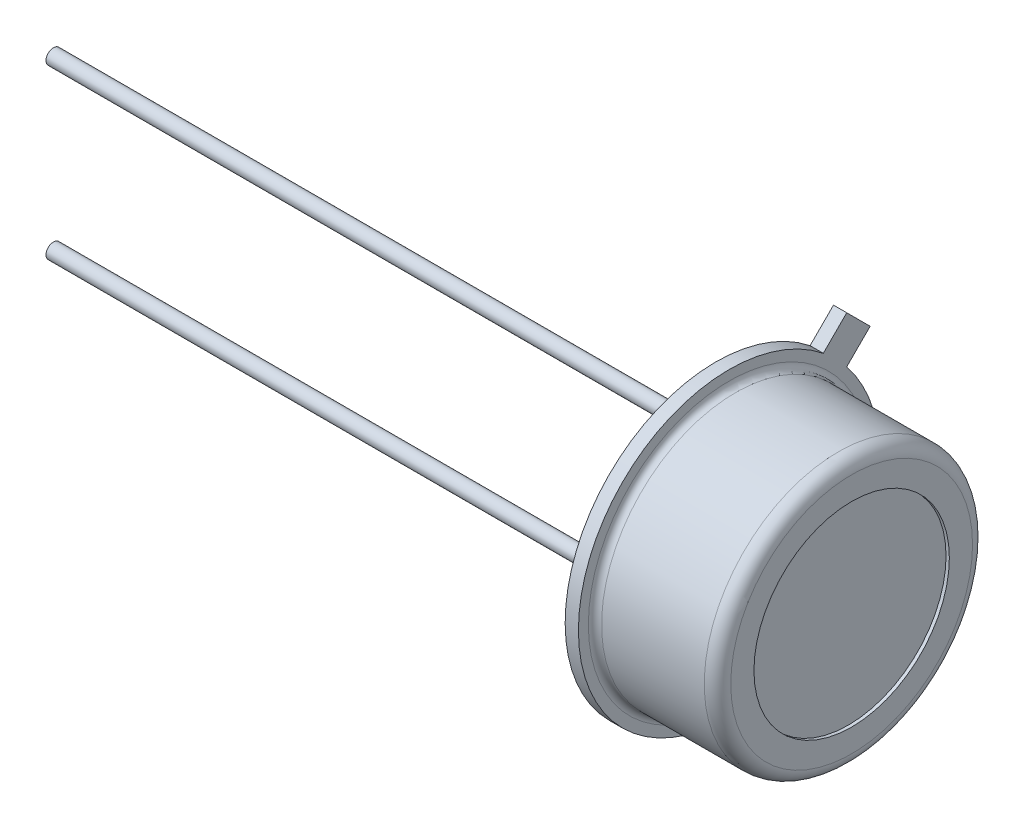
ISO-10303-21;
HEADER;
FILE_DESCRIPTION(('STEP AP214'),'2;1');
FILE_NAME('part.step','',(''),(''),'','','');
FILE_SCHEMA(('AUTOMOTIVE_DESIGN { 1 0 10303 214 1 1 1 1 }'));
ENDSEC;
DATA;
#1=APPLICATION_CONTEXT('core data for automotive mechanical design processes');
#2=APPLICATION_PROTOCOL_DEFINITION('international standard','automotive_design',2000,#1);
#3=PRODUCT_CONTEXT('',#1,'mechanical');
#4=PRODUCT('Part','Part','',(#3));
#5=PRODUCT_RELATED_PRODUCT_CATEGORY('part','',(#4));
#6=PRODUCT_DEFINITION_FORMATION('','',#4);
#7=PRODUCT_DEFINITION_CONTEXT('part definition',#1,'design');
#8=PRODUCT_DEFINITION('design','',#6,#7);
#9=PRODUCT_DEFINITION_SHAPE('','',#8);
#10=(LENGTH_UNIT() NAMED_UNIT(*) SI_UNIT(.MILLI.,.METRE.));
#11=(NAMED_UNIT(*) PLANE_ANGLE_UNIT() SI_UNIT($,.RADIAN.));
#12=(NAMED_UNIT(*) SI_UNIT($,.STERADIAN.) SOLID_ANGLE_UNIT());
#13=UNCERTAINTY_MEASURE_WITH_UNIT(LENGTH_MEASURE(1.E-05),#10,'distance_accuracy_value','');
#14=(GEOMETRIC_REPRESENTATION_CONTEXT(3) GLOBAL_UNCERTAINTY_ASSIGNED_CONTEXT((#13)) GLOBAL_UNIT_ASSIGNED_CONTEXT((#10,
#11,#12)) REPRESENTATION_CONTEXT('',''));
#15=CARTESIAN_POINT('',(0.,0.,0.));
#16=DIRECTION('',(0.,0.,1.));
#17=DIRECTION('',(1.,0.,0.));
#18=AXIS2_PLACEMENT_3D('',#15,#16,#17);
#19=CARTESIAN_POINT('',(0.,0.,0.));
#20=DIRECTION('',(-1.,0.,0.));
#21=DIRECTION('',(0.,0.,-1.));
#22=AXIS2_PLACEMENT_3D('',#19,#20,#21);
#23=PLANE('',#22);
#24=CARTESIAN_POINT('',(0.,0.,0.));
#25=DIRECTION('',(1.,0.,0.));
#26=DIRECTION('',(0.,0.780528402503835,-0.625120318726572));
#27=AXIS2_PLACEMENT_3D('',#24,#25,#26);
#28=CIRCLE('',#27,4.55);
#29=CARTESIAN_POINT('',(0.,3.55140423139245,-2.8442974502059));
#30=VERTEX_POINT('',#29);
#31=CARTESIAN_POINT('',(0.,2.8442974502059,-3.55140423139245));
#32=VERTEX_POINT('',#31);
#33=EDGE_CURVE('P0_E11',#30,#32,#28,.T.);
#34=ORIENTED_EDGE('',*,*,#33,.F.);
#35=DIRECTION('',(0.,0.707106781186547,-0.707106781186548));
#36=VECTOR('',#35,1.);
#37=CARTESIAN_POINT('',(0.,3.55140423139245,-2.8442974502059));
#38=LINE('',#37,#36);
#39=CARTESIAN_POINT('',(0.,4.258511012579,-3.55140423139245));
#40=VERTEX_POINT('',#39);
#41=EDGE_CURVE('P0_E201',#30,#40,#38,.T.);
#42=ORIENTED_EDGE('',*,*,#41,.T.);
#43=DIRECTION('',(0.,-0.707106781186547,-0.707106781186548));
#44=VECTOR('',#43,1.);
#45=CARTESIAN_POINT('',(0.,4.258511012579,-3.55140423139245));
#46=LINE('',#45,#44);
#47=CARTESIAN_POINT('',(0.,3.55140423139245,-4.258511012579));
#48=VERTEX_POINT('',#47);
#49=EDGE_CURVE('P0_E189',#40,#48,#46,.T.);
#50=ORIENTED_EDGE('',*,*,#49,.T.);
#51=DIRECTION('',(0.,-0.707106781186547,0.707106781186548));
#52=VECTOR('',#51,1.);
#53=CARTESIAN_POINT('',(0.,3.55140423139245,-4.258511012579));
#54=LINE('',#53,#52);
#55=EDGE_CURVE('P0_E177',#48,#32,#54,.T.);
#56=ORIENTED_EDGE('',*,*,#55,.T.);
#57=EDGE_LOOP('',(#34,#42,#50,#56));
#58=FACE_BOUND('',#57,.T.);
#59=CARTESIAN_POINT('',(0.,2.54,0.));
#60=DIRECTION('',(-1.,0.,0.));
#61=DIRECTION('',(0.,0.,-1.));
#62=AXIS2_PLACEMENT_3D('',#59,#60,#61);
#63=CIRCLE('',#62,0.225);
#64=CARTESIAN_POINT('',(0.,2.54,-0.224999999999999));
#65=VERTEX_POINT('',#64);
#66=EDGE_CURVE('P0_E198',#65,#65,#63,.T.);
#67=ORIENTED_EDGE('',*,*,#66,.F.);
#68=EDGE_LOOP('',(#67));
#69=FACE_BOUND('',#68,.T.);
#70=CARTESIAN_POINT('',(0.,-2.54,0.));
#71=DIRECTION('',(-1.,0.,0.));
#72=DIRECTION('',(0.,0.,-1.));
#73=AXIS2_PLACEMENT_3D('',#70,#71,#72);
#74=CIRCLE('',#73,0.225);
#75=CARTESIAN_POINT('',(0.,-2.54,-0.225));
#76=VERTEX_POINT('',#75);
#77=EDGE_CURVE('P0_E186',#76,#76,#74,.T.);
#78=ORIENTED_EDGE('',*,*,#77,.F.);
#79=EDGE_LOOP('',(#78));
#80=FACE_BOUND('',#79,.T.);
#81=ADVANCED_FACE('P0_F17',(#58,#69,#80),#23,.T.);
#82=CARTESIAN_POINT('',(0.4,0.,0.));
#83=DIRECTION('',(1.,0.,0.));
#84=DIRECTION('',(0.,0.,-1.));
#85=AXIS2_PLACEMENT_3D('',#82,#83,#84);
#86=PLANE('',#85);
#87=DIRECTION('',(0.,0.707106781186547,-0.707106781186548));
#88=VECTOR('',#87,1.);
#89=CARTESIAN_POINT('',(0.4,2.8442974502059,-3.55140423139245));
#90=LINE('',#89,#88);
#91=CARTESIAN_POINT('',(0.4,2.8442974502059,-3.55140423139245));
#92=VERTEX_POINT('',#91);
#93=CARTESIAN_POINT('',(0.4,3.55140423139245,-4.258511012579));
#94=VERTEX_POINT('',#93);
#95=EDGE_CURVE('P0_E24',#92,#94,#90,.T.);
#96=ORIENTED_EDGE('',*,*,#95,.T.);
#97=DIRECTION('',(0.,0.707106781186547,0.707106781186548));
#98=VECTOR('',#97,1.);
#99=CARTESIAN_POINT('',(0.4,3.55140423139245,-4.258511012579));
#100=LINE('',#99,#98);
#101=CARTESIAN_POINT('',(0.4,4.258511012579,-3.55140423139245));
#102=VERTEX_POINT('',#101);
#103=EDGE_CURVE('P0_E194',#94,#102,#100,.T.);
#104=ORIENTED_EDGE('',*,*,#103,.T.);
#105=DIRECTION('',(0.,-0.707106781186547,0.707106781186548));
#106=VECTOR('',#105,1.);
#107=CARTESIAN_POINT('',(0.4,4.258511012579,-3.55140423139245));
#108=LINE('',#107,#106);
#109=CARTESIAN_POINT('',(0.4,3.55140423139245,-2.8442974502059));
#110=VERTEX_POINT('',#109);
#111=EDGE_CURVE('P0_E179',#102,#110,#108,.T.);
#112=ORIENTED_EDGE('',*,*,#111,.T.);
#113=CARTESIAN_POINT('',(0.4,0.,0.));
#114=DIRECTION('',(1.,0.,0.));
#115=DIRECTION('',(0.,0.780528402503835,-0.625120318726572));
#116=AXIS2_PLACEMENT_3D('',#113,#114,#115);
#117=CIRCLE('',#116,4.55);
#118=EDGE_CURVE('P0_E182',#110,#92,#117,.T.);
#119=ORIENTED_EDGE('',*,*,#118,.T.);
#120=EDGE_LOOP('',(#96,#104,#112,#119));
#121=FACE_BOUND('',#120,.T.);
#122=CARTESIAN_POINT('',(0.4,0.,0.));
#123=DIRECTION('',(1.,0.,0.));
#124=DIRECTION('',(0.,0.,-1.));
#125=AXIS2_PLACEMENT_3D('',#122,#123,#124);
#126=CIRCLE('',#125,4.25);
#127=CARTESIAN_POINT('',(0.4,0.,-4.25));
#128=VERTEX_POINT('',#127);
#129=EDGE_CURVE('P0_E191',#128,#128,#126,.T.);
#130=ORIENTED_EDGE('',*,*,#129,.F.);
#131=EDGE_LOOP('',(#130));
#132=FACE_BOUND('',#131,.T.);
#133=ADVANCED_FACE('P0_F219',(#121,#132),#86,.T.);
#134=CARTESIAN_POINT('',(0.,0.,0.));
#135=DIRECTION('',(1.,0.,0.));
#136=DIRECTION('',(0.,0.,-1.));
#137=AXIS2_PLACEMENT_3D('',#134,#135,#136);
#138=CYLINDRICAL_SURFACE('',#137,4.55);
#139=DIRECTION('',(1.,0.,0.));
#140=VECTOR('',#139,1.);
#141=CARTESIAN_POINT('',(0.,2.8442974502059,-3.55140423139245));
#142=LINE('',#141,#140);
#143=EDGE_CURVE('P0_E196',#32,#92,#142,.T.);
#144=ORIENTED_EDGE('',*,*,#143,.T.);
#145=ORIENTED_EDGE('',*,*,#118,.F.);
#146=DIRECTION('',(1.,0.,0.));
#147=VECTOR('',#146,1.);
#148=CARTESIAN_POINT('',(0.,3.55140423139245,-2.8442974502059));
#149=LINE('',#148,#147);
#150=EDGE_CURVE('P0_E184',#30,#110,#149,.T.);
#151=ORIENTED_EDGE('',*,*,#150,.F.);
#152=ORIENTED_EDGE('',*,*,#33,.T.);
#153=EDGE_LOOP('',(#144,#145,#151,#152));
#154=FACE_BOUND('',#153,.T.);
#155=ADVANCED_FACE('P0_F218',(#154),#138,.T.);
#156=CARTESIAN_POINT('',(1.4,3.55140423139245,-2.8442974502059));
#157=DIRECTION('',(0.,0.707106781186548,0.707106781186548));
#158=DIRECTION('',(0.,0.707106781186548,-0.707106781186548));
#159=AXIS2_PLACEMENT_3D('',#156,#157,#158);
#160=PLANE('',#159);
#161=ORIENTED_EDGE('',*,*,#150,.T.);
#162=ORIENTED_EDGE('',*,*,#111,.F.);
#163=DIRECTION('',(-1.,0.,0.));
#164=VECTOR('',#163,1.);
#165=CARTESIAN_POINT('',(0.4,4.258511012579,-3.55140423139245));
#166=LINE('',#165,#164);
#167=EDGE_CURVE('P0_E174',#102,#40,#166,.T.);
#168=ORIENTED_EDGE('',*,*,#167,.T.);
#169=ORIENTED_EDGE('',*,*,#41,.F.);
#170=EDGE_LOOP('',(#161,#162,#168,#169));
#171=FACE_BOUND('',#170,.T.);
#172=ADVANCED_FACE('P0_F209',(#171),#160,.T.);
#173=CARTESIAN_POINT('',(1.4,3.55140423139245,-4.258511012579));
#174=DIRECTION('',(0.,-0.707106781186548,-0.707106781186547));
#175=DIRECTION('',(0.,-0.707106781186547,0.707106781186548));
#176=AXIS2_PLACEMENT_3D('',#173,#174,#175);
#177=PLANE('',#176);
#178=ORIENTED_EDGE('',*,*,#143,.F.);
#179=ORIENTED_EDGE('',*,*,#55,.F.);
#180=DIRECTION('',(-1.,0.,0.));
#181=VECTOR('',#180,1.);
#182=CARTESIAN_POINT('',(0.4,3.55140423139245,-4.258511012579));
#183=LINE('',#182,#181);
#184=EDGE_CURVE('P0_E171',#94,#48,#183,.T.);
#185=ORIENTED_EDGE('',*,*,#184,.F.);
#186=ORIENTED_EDGE('',*,*,#95,.F.);
#187=EDGE_LOOP('',(#178,#179,#185,#186));
#188=FACE_BOUND('',#187,.T.);
#189=ADVANCED_FACE('P0_F215',(#188),#177,.T.);
#190=CARTESIAN_POINT('',(1.4,4.258511012579,-3.55140423139245));
#191=DIRECTION('',(0.,0.707106781186548,-0.707106781186547));
#192=DIRECTION('',(0.,-0.707106781186547,-0.707106781186548));
#193=AXIS2_PLACEMENT_3D('',#190,#191,#192);
#194=PLANE('',#193);
#195=ORIENTED_EDGE('',*,*,#103,.F.);
#196=ORIENTED_EDGE('',*,*,#184,.T.);
#197=ORIENTED_EDGE('',*,*,#49,.F.);
#198=ORIENTED_EDGE('',*,*,#167,.F.);
#199=EDGE_LOOP('',(#195,#196,#197,#198));
#200=FACE_BOUND('',#199,.T.);
#201=ADVANCED_FACE('P0_F211',(#200),#194,.T.);
#202=CARTESIAN_POINT('',(0.,2.54,0.));
#203=DIRECTION('',(-1.,0.,0.));
#204=DIRECTION('',(0.,0.,-1.));
#205=AXIS2_PLACEMENT_3D('',#202,#203,#204);
#206=CYLINDRICAL_SURFACE('',#205,0.225);
#207=ORIENTED_EDGE('',*,*,#66,.T.);
#208=EDGE_LOOP('',(#207));
#209=FACE_BOUND('',#208,.T.);
#210=CARTESIAN_POINT('',(-20.,2.54,0.));
#211=DIRECTION('',(-1.,0.,0.));
#212=DIRECTION('',(0.,0.,-1.));
#213=AXIS2_PLACEMENT_3D('',#210,#211,#212);
#214=CIRCLE('',#213,0.225);
#215=CARTESIAN_POINT('',(-20.,2.54,-0.224999999999999));
#216=VERTEX_POINT('',#215);
#217=EDGE_CURVE('P0_E168',#216,#216,#214,.T.);
#218=ORIENTED_EDGE('',*,*,#217,.F.);
#219=EDGE_LOOP('',(#218));
#220=FACE_BOUND('',#219,.T.);
#221=ADVANCED_FACE('P0_F237',(#209,#220),#206,.T.);
#222=CARTESIAN_POINT('',(0.,-2.54,0.));
#223=DIRECTION('',(-1.,0.,0.));
#224=DIRECTION('',(0.,0.,-1.));
#225=AXIS2_PLACEMENT_3D('',#222,#223,#224);
#226=CYLINDRICAL_SURFACE('',#225,0.225);
#227=ORIENTED_EDGE('',*,*,#77,.T.);
#228=EDGE_LOOP('',(#227));
#229=FACE_BOUND('',#228,.T.);
#230=CARTESIAN_POINT('',(-20.,-2.54,0.));
#231=DIRECTION('',(-1.,0.,0.));
#232=DIRECTION('',(0.,0.,-1.));
#233=AXIS2_PLACEMENT_3D('',#230,#231,#232);
#234=CIRCLE('',#233,0.225);
#235=CARTESIAN_POINT('',(-20.,-2.54,-0.225));
#236=VERTEX_POINT('',#235);
#237=EDGE_CURVE('P0_E162',#236,#236,#234,.T.);
#238=ORIENTED_EDGE('',*,*,#237,.F.);
#239=EDGE_LOOP('',(#238));
#240=FACE_BOUND('',#239,.T.);
#241=ADVANCED_FACE('P0_F226',(#229,#240),#226,.T.);
#242=CARTESIAN_POINT('',(0.599999999999999,0.,0.));
#243=DIRECTION('',(1.,0.,0.));
#244=DIRECTION('',(0.,0.,-1.));
#245=AXIS2_PLACEMENT_3D('',#242,#243,#244);
#246=TOROIDAL_SURFACE('',#245,4.25,0.2);
#247=CARTESIAN_POINT('',(0.599999999999999,0.,0.));
#248=DIRECTION('',(1.,0.,0.));
#249=DIRECTION('',(0.,0.,-1.));
#250=AXIS2_PLACEMENT_3D('',#247,#248,#249);
#251=CIRCLE('',#250,4.05);
#252=CARTESIAN_POINT('',(0.599999999999999,0.,-4.05));
#253=VERTEX_POINT('',#252);
#254=EDGE_CURVE('P0_E165',#253,#253,#251,.T.);
#255=ORIENTED_EDGE('',*,*,#254,.F.);
#256=EDGE_LOOP('',(#255));
#257=FACE_BOUND('',#256,.T.);
#258=ORIENTED_EDGE('',*,*,#129,.T.);
#259=EDGE_LOOP('',(#258));
#260=FACE_BOUND('',#259,.T.);
#261=ADVANCED_FACE('P0_F223',(#257,#260),#246,.F.);
#262=CARTESIAN_POINT('',(-20.,5.08,0.));
#263=DIRECTION('',(-1.,0.,0.));
#264=DIRECTION('',(0.,0.,-1.));
#265=AXIS2_PLACEMENT_3D('',#262,#263,#264);
#266=PLANE('',#265);
#267=ORIENTED_EDGE('',*,*,#217,.T.);
#268=EDGE_LOOP('',(#267));
#269=FACE_BOUND('',#268,.T.);
#270=ADVANCED_FACE('P0_F225',(#269),#266,.T.);
#271=CARTESIAN_POINT('',(-20.,0.,0.));
#272=DIRECTION('',(-1.,0.,0.));
#273=DIRECTION('',(0.,0.,-1.));
#274=AXIS2_PLACEMENT_3D('',#271,#272,#273);
#275=PLANE('',#274);
#276=ORIENTED_EDGE('',*,*,#237,.T.);
#277=EDGE_LOOP('',(#276));
#278=FACE_BOUND('',#277,.T.);
#279=ADVANCED_FACE('P0_F234',(#278),#275,.T.);
#280=CARTESIAN_POINT('',(0.599999999999999,0.,0.));
#281=DIRECTION('',(1.,0.,0.));
#282=DIRECTION('',(0.,0.,-1.));
#283=AXIS2_PLACEMENT_3D('',#280,#281,#282);
#284=CYLINDRICAL_SURFACE('',#283,4.05);
#285=CARTESIAN_POINT('',(3.7,0.,0.));
#286=DIRECTION('',(1.,0.,0.));
#287=DIRECTION('',(0.,0.,-1.));
#288=AXIS2_PLACEMENT_3D('',#285,#286,#287);
#289=CIRCLE('',#288,4.05);
#290=CARTESIAN_POINT('',(3.7,0.,-4.05));
#291=VERTEX_POINT('',#290);
#292=EDGE_CURVE('P0_E159',#291,#291,#289,.T.);
#293=ORIENTED_EDGE('',*,*,#292,.F.);
#294=EDGE_LOOP('',(#293));
#295=FACE_BOUND('',#294,.T.);
#296=ORIENTED_EDGE('',*,*,#254,.T.);
#297=EDGE_LOOP('',(#296));
#298=FACE_BOUND('',#297,.T.);
#299=ADVANCED_FACE('P0_F311',(#295,#298),#284,.T.);
#300=CARTESIAN_POINT('',(3.7,0.,0.));
#301=DIRECTION('',(1.,0.,0.));
#302=DIRECTION('',(0.,0.,-1.));
#303=AXIS2_PLACEMENT_3D('',#300,#301,#302);
#304=TOROIDAL_SURFACE('',#303,3.65,0.4);
#305=CARTESIAN_POINT('',(4.1,0.,0.));
#306=DIRECTION('',(1.,0.,0.));
#307=DIRECTION('',(0.,0.,-1.));
#308=AXIS2_PLACEMENT_3D('',#305,#306,#307);
#309=CIRCLE('',#308,3.65);
#310=CARTESIAN_POINT('',(4.1,0.,-3.65));
#311=VERTEX_POINT('',#310);
#312=EDGE_CURVE('P0_E156',#311,#311,#309,.T.);
#313=ORIENTED_EDGE('',*,*,#312,.F.);
#314=EDGE_LOOP('',(#313));
#315=FACE_BOUND('',#314,.T.);
#316=ORIENTED_EDGE('',*,*,#292,.T.);
#317=EDGE_LOOP('',(#316));
#318=FACE_BOUND('',#317,.T.);
#319=ADVANCED_FACE('P0_F417',(#315,#318),#304,.T.);
#320=CARTESIAN_POINT('',(4.1,0.,0.));
#321=DIRECTION('',(1.,0.,0.));
#322=DIRECTION('',(0.,0.,-1.));
#323=AXIS2_PLACEMENT_3D('',#320,#321,#322);
#324=PLANE('',#323);
#325=ORIENTED_EDGE('',*,*,#312,.T.);
#326=EDGE_LOOP('',(#325));
#327=FACE_BOUND('',#326,.T.);
#328=CARTESIAN_POINT('',(4.1,0.,0.));
#329=DIRECTION('',(1.,0.,0.));
#330=DIRECTION('',(0.,0.,1.));
#331=AXIS2_PLACEMENT_3D('',#328,#329,#330);
#332=CIRCLE('',#331,2.95);
#333=CARTESIAN_POINT('',(4.1,0.,2.95));
#334=VERTEX_POINT('',#333);
#335=EDGE_CURVE('P0_E154',#334,#334,#332,.T.);
#336=ORIENTED_EDGE('',*,*,#335,.F.);
#337=EDGE_LOOP('',(#336));
#338=FACE_BOUND('',#337,.T.);
#339=ADVANCED_FACE('P0_F406',(#327,#338),#324,.T.);
#340=CARTESIAN_POINT('',(2.1,0.,0.));
#341=DIRECTION('',(1.,0.,0.));
#342=DIRECTION('',(0.,0.,1.));
#343=AXIS2_PLACEMENT_3D('',#340,#341,#342);
#344=CYLINDRICAL_SURFACE('',#343,2.95);
#345=ORIENTED_EDGE('',*,*,#335,.T.);
#346=EDGE_LOOP('',(#345));
#347=FACE_BOUND('',#346,.T.);
#348=CARTESIAN_POINT('',(2.1,0.,0.));
#349=DIRECTION('',(1.,0.,0.));
#350=DIRECTION('',(0.,0.,1.));
#351=AXIS2_PLACEMENT_3D('',#348,#349,#350);
#352=CIRCLE('',#351,2.95);
#353=CARTESIAN_POINT('',(2.1,0.,2.95));
#354=VERTEX_POINT('',#353);
#355=EDGE_CURVE('P0_E152',#354,#354,#352,.T.);
#356=ORIENTED_EDGE('',*,*,#355,.F.);
#357=EDGE_LOOP('',(#356));
#358=FACE_BOUND('',#357,.T.);
#359=ADVANCED_FACE('P0_F395',(#347,#358),#344,.F.);
#360=CARTESIAN_POINT('',(2.1,0.,0.));
#361=DIRECTION('',(1.,0.,0.));
#362=DIRECTION('',(0.,0.,1.));
#363=AXIS2_PLACEMENT_3D('',#360,#361,#362);
#364=PLANE('',#363);
#365=ORIENTED_EDGE('',*,*,#355,.T.);
#366=EDGE_LOOP('',(#365));
#367=FACE_BOUND('',#366,.T.);
#368=DIRECTION('',(0.,-1.,0.));
#369=VECTOR('',#368,1.);
#370=CARTESIAN_POINT('',(2.1,1.2,1.2));
#371=LINE('',#370,#369);
#372=CARTESIAN_POINT('',(2.1,1.2,1.2));
#373=VERTEX_POINT('',#372);
#374=CARTESIAN_POINT('',(2.1,-1.2,1.2));
#375=VERTEX_POINT('',#374);
#376=EDGE_CURVE('P0_E150',#373,#375,#371,.T.);
#377=ORIENTED_EDGE('',*,*,#376,.F.);
#378=DIRECTION('',(0.,0.,1.));
#379=VECTOR('',#378,1.);
#380=CARTESIAN_POINT('',(2.1,1.2,-1.2));
#381=LINE('',#380,#379);
#382=CARTESIAN_POINT('',(2.1,1.2,-1.2));
#383=VERTEX_POINT('',#382);
#384=EDGE_CURVE('P0_E147',#383,#373,#381,.T.);
#385=ORIENTED_EDGE('',*,*,#384,.F.);
#386=DIRECTION('',(0.,1.,0.));
#387=VECTOR('',#386,1.);
#388=CARTESIAN_POINT('',(2.1,-1.2,-1.2));
#389=LINE('',#388,#387);
#390=CARTESIAN_POINT('',(2.1,-1.2,-1.2));
#391=VERTEX_POINT('',#390);
#392=EDGE_CURVE('P0_E143',#391,#383,#389,.T.);
#393=ORIENTED_EDGE('',*,*,#392,.F.);
#394=DIRECTION('',(0.,0.,-1.));
#395=VECTOR('',#394,1.);
#396=CARTESIAN_POINT('',(2.1,-1.2,1.2));
#397=LINE('',#396,#395);
#398=EDGE_CURVE('P0_E117',#375,#391,#397,.T.);
#399=ORIENTED_EDGE('',*,*,#398,.F.);
#400=EDGE_LOOP('',(#377,#385,#393,#399));
#401=FACE_BOUND('',#400,.T.);
#402=ADVANCED_FACE('P0_F326',(#367,#401),#364,.T.);
#403=CARTESIAN_POINT('',(2.1,1.2,1.2));
#404=DIRECTION('',(0.,0.,1.));
#405=DIRECTION('',(0.,-1.,0.));
#406=AXIS2_PLACEMENT_3D('',#403,#404,#405);
#407=PLANE('',#406);
#408=ORIENTED_EDGE('',*,*,#376,.T.);
#409=DIRECTION('',(1.,0.,0.));
#410=VECTOR('',#409,1.);
#411=CARTESIAN_POINT('',(2.1,-1.2,1.2));
#412=LINE('',#411,#410);
#413=CARTESIAN_POINT('',(2.8,-1.2,1.2));
#414=VERTEX_POINT('',#413);
#415=EDGE_CURVE('P0_E145',#375,#414,#412,.T.);
#416=ORIENTED_EDGE('',*,*,#415,.T.);
#417=DIRECTION('',(0.,-1.,0.));
#418=VECTOR('',#417,1.);
#419=CARTESIAN_POINT('',(2.8,1.2,1.2));
#420=LINE('',#419,#418);
#421=CARTESIAN_POINT('',(2.8,1.2,1.2));
#422=VERTEX_POINT('',#421);
#423=EDGE_CURVE('P0_E134',#422,#414,#420,.T.);
#424=ORIENTED_EDGE('',*,*,#423,.F.);
#425=DIRECTION('',(1.,0.,0.));
#426=VECTOR('',#425,1.);
#427=CARTESIAN_POINT('',(2.1,1.2,1.2));
#428=LINE('',#427,#426);
#429=EDGE_CURVE('P0_E141',#373,#422,#428,.T.);
#430=ORIENTED_EDGE('',*,*,#429,.F.);
#431=EDGE_LOOP('',(#408,#416,#424,#430));
#432=FACE_BOUND('',#431,.T.);
#433=ADVANCED_FACE('P0_F320',(#432),#407,.T.);
#434=CARTESIAN_POINT('',(2.1,1.2,-1.2));
#435=DIRECTION('',(0.,1.,0.));
#436=DIRECTION('',(0.,0.,1.));
#437=AXIS2_PLACEMENT_3D('',#434,#435,#436);
#438=PLANE('',#437);
#439=ORIENTED_EDGE('',*,*,#384,.T.);
#440=ORIENTED_EDGE('',*,*,#429,.T.);
#441=DIRECTION('',(0.,0.,1.));
#442=VECTOR('',#441,1.);
#443=CARTESIAN_POINT('',(2.8,1.2,-1.2));
#444=LINE('',#443,#442);
#445=CARTESIAN_POINT('',(2.8,1.2,-1.2));
#446=VERTEX_POINT('',#445);
#447=EDGE_CURVE('P0_E120',#446,#422,#444,.T.);
#448=ORIENTED_EDGE('',*,*,#447,.F.);
#449=DIRECTION('',(1.,0.,0.));
#450=VECTOR('',#449,1.);
#451=CARTESIAN_POINT('',(2.1,1.2,-1.2));
#452=LINE('',#451,#450);
#453=EDGE_CURVE('P0_E126',#383,#446,#452,.T.);
#454=ORIENTED_EDGE('',*,*,#453,.F.);
#455=EDGE_LOOP('',(#439,#440,#448,#454));
#456=FACE_BOUND('',#455,.T.);
#457=ADVANCED_FACE('P0_F325',(#456),#438,.T.);
#458=CARTESIAN_POINT('',(2.1,-1.2,-1.2));
#459=DIRECTION('',(0.,0.,-1.));
#460=DIRECTION('',(0.,1.,0.));
#461=AXIS2_PLACEMENT_3D('',#458,#459,#460);
#462=PLANE('',#461);
#463=ORIENTED_EDGE('',*,*,#392,.T.);
#464=ORIENTED_EDGE('',*,*,#453,.T.);
#465=DIRECTION('',(0.,1.,0.));
#466=VECTOR('',#465,1.);
#467=CARTESIAN_POINT('',(2.8,-1.2,-1.2));
#468=LINE('',#467,#466);
#469=CARTESIAN_POINT('',(2.8,-1.2,-1.2));
#470=VERTEX_POINT('',#469);
#471=EDGE_CURVE('P0_E121',#470,#446,#468,.T.);
#472=ORIENTED_EDGE('',*,*,#471,.F.);
#473=DIRECTION('',(1.,0.,0.));
#474=VECTOR('',#473,1.);
#475=CARTESIAN_POINT('',(2.1,-1.2,-1.2));
#476=LINE('',#475,#474);
#477=EDGE_CURVE('P0_E110',#391,#470,#476,.T.);
#478=ORIENTED_EDGE('',*,*,#477,.F.);
#479=EDGE_LOOP('',(#463,#464,#472,#478));
#480=FACE_BOUND('',#479,.T.);
#481=ADVANCED_FACE('P0_F124',(#480),#462,.T.);
#482=CARTESIAN_POINT('',(2.1,-1.2,1.2));
#483=DIRECTION('',(0.,-1.,0.));
#484=DIRECTION('',(0.,0.,-1.));
#485=AXIS2_PLACEMENT_3D('',#482,#483,#484);
#486=PLANE('',#485);
#487=ORIENTED_EDGE('',*,*,#398,.T.);
#488=ORIENTED_EDGE('',*,*,#477,.T.);
#489=DIRECTION('',(0.,0.,-1.));
#490=VECTOR('',#489,1.);
#491=CARTESIAN_POINT('',(2.8,-1.2,1.2));
#492=LINE('',#491,#490);
#493=EDGE_CURVE('P0_E115',#414,#470,#492,.T.);
#494=ORIENTED_EDGE('',*,*,#493,.F.);
#495=ORIENTED_EDGE('',*,*,#415,.F.);
#496=EDGE_LOOP('',(#487,#488,#494,#495));
#497=FACE_BOUND('',#496,.T.);
#498=ADVANCED_FACE('P0_F112',(#497),#486,.T.);
#499=CARTESIAN_POINT('',(2.8,0.,0.));
#500=DIRECTION('',(1.,0.,0.));
#501=DIRECTION('',(0.,0.,1.));
#502=AXIS2_PLACEMENT_3D('',#499,#500,#501);
#503=PLANE('',#502);
#504=ORIENTED_EDGE('',*,*,#423,.T.);
#505=ORIENTED_EDGE('',*,*,#493,.T.);
#506=ORIENTED_EDGE('',*,*,#471,.T.);
#507=ORIENTED_EDGE('',*,*,#447,.T.);
#508=EDGE_LOOP('',(#504,#505,#506,#507));
#509=FACE_BOUND('',#508,.T.);
#510=ADVANCED_FACE('P0_F132',(#509),#503,.T.);
#511=CLOSED_SHELL('',(#81,#133,#155,#172,#189,#201,#221,#241,#261,#270,#279,#299,#319,#339,#359,
#402,#433,#457,#481,#498,#510));
#512=MANIFOLD_SOLID_BREP('P0_B1',#511);
#513=CARTESIAN_POINT('',(4.,0.,0.));
#514=DIRECTION('',(1.,0.,0.));
#515=DIRECTION('',(0.,0.,-1.));
#516=AXIS2_PLACEMENT_3D('',#513,#514,#515);
#517=PLANE('',#516);
#518=CARTESIAN_POINT('',(4.,0.,0.));
#519=DIRECTION('',(1.,0.,0.));
#520=DIRECTION('',(0.,0.,1.));
#521=AXIS2_PLACEMENT_3D('',#518,#519,#520);
#522=CIRCLE('',#521,2.95);
#523=CARTESIAN_POINT('',(4.,0.,2.95));
#524=VERTEX_POINT('',#523);
#525=EDGE_CURVE('P1_E11',#524,#524,#522,.T.);
#526=ORIENTED_EDGE('',*,*,#525,.T.);
#527=EDGE_LOOP('',(#526));
#528=FACE_BOUND('',#527,.T.);
#529=ADVANCED_FACE('P1_F17',(#528),#517,.T.);
#530=CARTESIAN_POINT('',(2.8,0.,0.));
#531=DIRECTION('',(1.,0.,0.));
#532=DIRECTION('',(0.,0.,1.));
#533=AXIS2_PLACEMENT_3D('',#530,#531,#532);
#534=CYLINDRICAL_SURFACE('',#533,2.95);
#535=ORIENTED_EDGE('',*,*,#525,.F.);
#536=EDGE_LOOP('',(#535));
#537=FACE_BOUND('',#536,.T.);
#538=CARTESIAN_POINT('',(2.8,0.,0.));
#539=DIRECTION('',(1.,0.,0.));
#540=DIRECTION('',(0.,0.,1.));
#541=AXIS2_PLACEMENT_3D('',#538,#539,#540);
#542=CIRCLE('',#541,2.95);
#543=CARTESIAN_POINT('',(2.8,0.,2.95));
#544=VERTEX_POINT('',#543);
#545=EDGE_CURVE('P1_E24',#544,#544,#542,.T.);
#546=ORIENTED_EDGE('',*,*,#545,.T.);
#547=EDGE_LOOP('',(#546));
#548=FACE_BOUND('',#547,.T.);
#549=ADVANCED_FACE('P1_F33',(#537,#548),#534,.T.);
#550=CARTESIAN_POINT('',(2.8,0.,0.));
#551=DIRECTION('',(1.,0.,0.));
#552=DIRECTION('',(0.,0.,1.));
#553=AXIS2_PLACEMENT_3D('',#550,#551,#552);
#554=PLANE('',#553);
#555=ORIENTED_EDGE('',*,*,#545,.F.);
#556=EDGE_LOOP('',(#555));
#557=FACE_BOUND('',#556,.T.);
#558=ADVANCED_FACE('P1_F31',(#557),#554,.F.);
#559=CLOSED_SHELL('',(#529,#549,#558));
#560=MANIFOLD_SOLID_BREP('P1_B1',#559);
#561=ADVANCED_BREP_SHAPE_REPRESENTATION('',(#18,#512,#560),#14);
#562=SHAPE_DEFINITION_REPRESENTATION(#9,#561);
ENDSEC;
END-ISO-10303-21;
